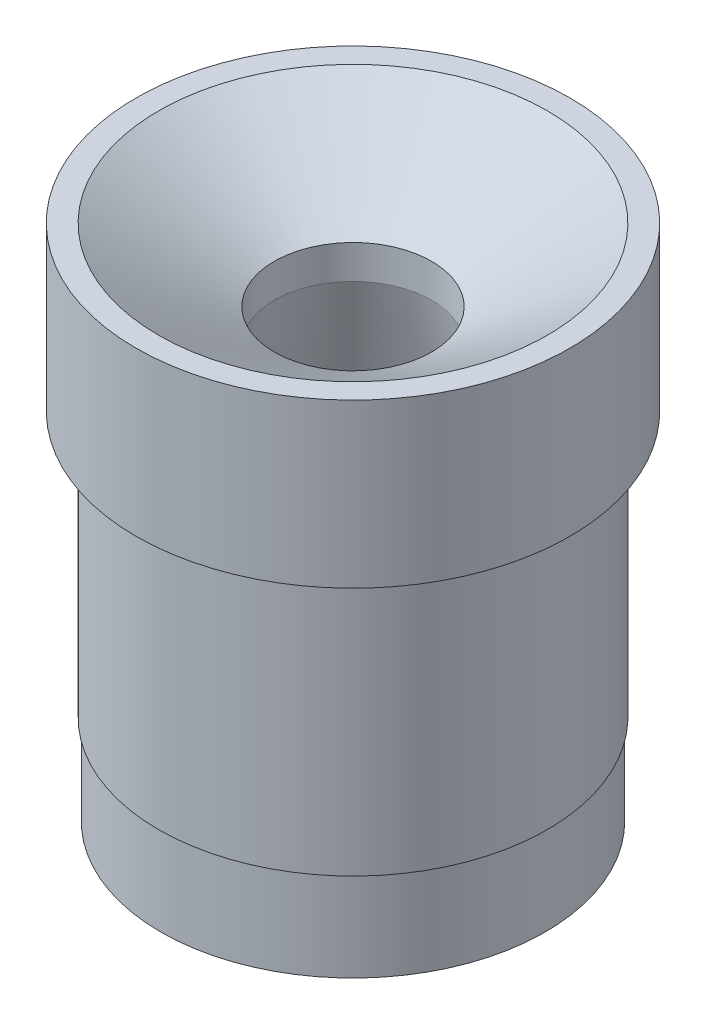
ISO-10303-21;
HEADER;
FILE_DESCRIPTION(('STEP AP214'),'2;1');
FILE_NAME('part.step','',(''),(''),'','','');
FILE_SCHEMA(('AUTOMOTIVE_DESIGN { 1 0 10303 214 1 1 1 1 }'));
ENDSEC;
DATA;
#1=APPLICATION_CONTEXT('core data for automotive mechanical design processes');
#2=APPLICATION_PROTOCOL_DEFINITION('international standard','automotive_design',2000,#1);
#3=PRODUCT_CONTEXT('',#1,'mechanical');
#4=PRODUCT('Part','Part','',(#3));
#5=PRODUCT_RELATED_PRODUCT_CATEGORY('part','',(#4));
#6=PRODUCT_DEFINITION_FORMATION('','',#4);
#7=PRODUCT_DEFINITION_CONTEXT('part definition',#1,'design');
#8=PRODUCT_DEFINITION('design','',#6,#7);
#9=PRODUCT_DEFINITION_SHAPE('','',#8);
#10=(LENGTH_UNIT() NAMED_UNIT(*) SI_UNIT(.MILLI.,.METRE.));
#11=(NAMED_UNIT(*) PLANE_ANGLE_UNIT() SI_UNIT($,.RADIAN.));
#12=(NAMED_UNIT(*) SI_UNIT($,.STERADIAN.) SOLID_ANGLE_UNIT());
#13=UNCERTAINTY_MEASURE_WITH_UNIT(LENGTH_MEASURE(1.E-05),#10,'distance_accuracy_value','');
#14=(GEOMETRIC_REPRESENTATION_CONTEXT(3) GLOBAL_UNCERTAINTY_ASSIGNED_CONTEXT((#13)) GLOBAL_UNIT_ASSIGNED_CONTEXT((#10,
#11,#12)) REPRESENTATION_CONTEXT('',''));
#15=CARTESIAN_POINT('',(0.,0.,0.));
#16=DIRECTION('',(0.,0.,1.));
#17=DIRECTION('',(1.,0.,0.));
#18=AXIS2_PLACEMENT_3D('',#15,#16,#17);
#19=CARTESIAN_POINT('',(0.,0.,-24.511));
#20=DIRECTION('',(0.,1.,0.));
#21=DIRECTION('',(0.,0.,1.));
#22=AXIS2_PLACEMENT_3D('',#19,#20,#21);
#23=PLANE('',#22);
#24=CARTESIAN_POINT('',(0.,0.,0.));
#25=DIRECTION('',(0.,1.,0.));
#26=DIRECTION('',(0.,0.,1.));
#27=AXIS2_PLACEMENT_3D('',#24,#25,#26);
#28=CIRCLE('',#27,24.511);
#29=CARTESIAN_POINT('',(0.,0.,24.511));
#30=VERTEX_POINT('',#29);
#31=EDGE_CURVE('E87',#30,#30,#28,.T.);
#32=ORIENTED_EDGE('',*,*,#31,.F.);
#33=EDGE_LOOP('',(#32));
#34=FACE_BOUND('',#33,.T.);
#35=CARTESIAN_POINT('',(0.,0.,0.));
#36=DIRECTION('',(0.,1.,0.));
#37=DIRECTION('',(0.,0.,1.));
#38=AXIS2_PLACEMENT_3D('',#35,#36,#37);
#39=CIRCLE('',#38,21.971);
#40=CARTESIAN_POINT('',(0.,0.,21.971));
#41=VERTEX_POINT('',#40);
#42=EDGE_CURVE('E10',#41,#41,#39,.T.);
#43=ORIENTED_EDGE('',*,*,#42,.T.);
#44=EDGE_LOOP('',(#43));
#45=FACE_BOUND('',#44,.T.);
#46=ADVANCED_FACE('F43',(#34,#45),#23,.F.);
#47=CARTESIAN_POINT('',(0.,21.55825,0.));
#48=DIRECTION('',(0.,1.,0.));
#49=DIRECTION('',(0.,0.,1.));
#50=AXIS2_PLACEMENT_3D('',#47,#48,#49);
#51=CYLINDRICAL_SURFACE('',#50,21.971);
#52=ORIENTED_EDGE('',*,*,#42,.F.);
#53=EDGE_LOOP('',(#52));
#54=FACE_BOUND('',#53,.T.);
#55=CARTESIAN_POINT('',(0.,-29.972,0.));
#56=DIRECTION('',(0.,1.,0.));
#57=DIRECTION('',(0.,0.,1.));
#58=AXIS2_PLACEMENT_3D('',#55,#56,#57);
#59=CIRCLE('',#58,21.971);
#60=CARTESIAN_POINT('',(0.,-29.972,21.971));
#61=VERTEX_POINT('',#60);
#62=EDGE_CURVE('E50',#61,#61,#59,.T.);
#63=ORIENTED_EDGE('',*,*,#62,.T.);
#64=EDGE_LOOP('',(#63));
#65=FACE_BOUND('',#64,.T.);
#66=ADVANCED_FACE('F94',(#54,#65),#51,.T.);
#67=CARTESIAN_POINT('',(0.,-29.972,-21.717));
#68=DIRECTION('',(0.,1.,0.));
#69=DIRECTION('',(0.,0.,1.));
#70=AXIS2_PLACEMENT_3D('',#67,#68,#69);
#71=PLANE('',#70);
#72=ORIENTED_EDGE('',*,*,#62,.F.);
#73=EDGE_LOOP('',(#72));
#74=FACE_BOUND('',#73,.T.);
#75=CARTESIAN_POINT('',(0.,-29.972,0.));
#76=DIRECTION('',(0.,1.,0.));
#77=DIRECTION('',(0.,0.,1.));
#78=AXIS2_PLACEMENT_3D('',#75,#76,#77);
#79=CIRCLE('',#78,21.717);
#80=CARTESIAN_POINT('',(0.,-29.972,21.717));
#81=VERTEX_POINT('',#80);
#82=EDGE_CURVE('E57',#81,#81,#79,.T.);
#83=ORIENTED_EDGE('',*,*,#82,.T.);
#84=EDGE_LOOP('',(#83));
#85=FACE_BOUND('',#84,.T.);
#86=ADVANCED_FACE('F99',(#74,#85),#71,.F.);
#87=CARTESIAN_POINT('',(0.,21.55825,0.));
#88=DIRECTION('',(0.,1.,0.));
#89=DIRECTION('',(0.,0.,1.));
#90=AXIS2_PLACEMENT_3D('',#87,#88,#89);
#91=CYLINDRICAL_SURFACE('',#90,21.717);
#92=ORIENTED_EDGE('',*,*,#82,.F.);
#93=EDGE_LOOP('',(#92));
#94=FACE_BOUND('',#93,.T.);
#95=CARTESIAN_POINT('',(0.,-40.132,0.));
#96=DIRECTION('',(0.,1.,0.));
#97=DIRECTION('',(0.,0.,1.));
#98=AXIS2_PLACEMENT_3D('',#95,#96,#97);
#99=CIRCLE('',#98,21.717);
#100=CARTESIAN_POINT('',(0.,-40.132,21.717));
#101=VERTEX_POINT('',#100);
#102=EDGE_CURVE('E63',#101,#101,#99,.T.);
#103=ORIENTED_EDGE('',*,*,#102,.T.);
#104=EDGE_LOOP('',(#103));
#105=FACE_BOUND('',#104,.T.);
#106=ADVANCED_FACE('F104',(#94,#105),#91,.T.);
#107=CARTESIAN_POINT('',(0.,-40.132,-21.717));
#108=DIRECTION('',(0.,1.,0.));
#109=DIRECTION('',(0.,0.,1.));
#110=AXIS2_PLACEMENT_3D('',#107,#108,#109);
#111=PLANE('',#110);
#112=ORIENTED_EDGE('',*,*,#102,.F.);
#113=EDGE_LOOP('',(#112));
#114=FACE_BOUND('',#113,.T.);
#115=CARTESIAN_POINT('',(0.,-40.132,0.));
#116=DIRECTION('',(0.,1.,0.));
#117=DIRECTION('',(0.,0.,1.));
#118=AXIS2_PLACEMENT_3D('',#115,#116,#117);
#119=CIRCLE('',#118,20.066);
#120=CARTESIAN_POINT('',(0.,-40.132,20.066));
#121=VERTEX_POINT('',#120);
#122=EDGE_CURVE('E69',#121,#121,#119,.T.);
#123=ORIENTED_EDGE('',*,*,#122,.T.);
#124=EDGE_LOOP('',(#123));
#125=FACE_BOUND('',#124,.T.);
#126=ADVANCED_FACE('F110',(#114,#125),#111,.F.);
#127=CARTESIAN_POINT('',(0.,6.4193902305304,0.));
#128=DIRECTION('',(0.,-1.,0.));
#129=DIRECTION('',(0.,0.,-1.));
#130=AXIS2_PLACEMENT_3D('',#127,#128,#129);
#131=CONICAL_SURFACE('',#130,8.89,0.235619449019235);
#132=ORIENTED_EDGE('',*,*,#122,.F.);
#133=EDGE_LOOP('',(#132));
#134=FACE_BOUND('',#133,.T.);
#135=CARTESIAN_POINT('',(0.,6.4193902305304,0.));
#136=DIRECTION('',(0.,1.,0.));
#137=DIRECTION('',(0.,0.,1.));
#138=AXIS2_PLACEMENT_3D('',#135,#136,#137);
#139=CIRCLE('',#138,8.89);
#140=CARTESIAN_POINT('',(0.,6.4193902305304,8.89));
#141=VERTEX_POINT('',#140);
#142=EDGE_CURVE('E73',#141,#141,#139,.T.);
#143=ORIENTED_EDGE('',*,*,#142,.T.);
#144=EDGE_LOOP('',(#143));
#145=FACE_BOUND('',#144,.T.);
#146=ADVANCED_FACE('F114',(#134,#145),#131,.F.);
#147=CARTESIAN_POINT('',(0.,21.55825,0.));
#148=DIRECTION('',(0.,1.,0.));
#149=DIRECTION('',(0.,0.,1.));
#150=AXIS2_PLACEMENT_3D('',#147,#148,#149);
#151=CYLINDRICAL_SURFACE('',#150,8.89);
#152=ORIENTED_EDGE('',*,*,#142,.F.);
#153=EDGE_LOOP('',(#152));
#154=FACE_BOUND('',#153,.T.);
#155=CARTESIAN_POINT('',(0.,10.2293902305304,0.));
#156=DIRECTION('',(0.,1.,0.));
#157=DIRECTION('',(0.,0.,1.));
#158=AXIS2_PLACEMENT_3D('',#155,#156,#157);
#159=CIRCLE('',#158,8.89);
#160=CARTESIAN_POINT('',(0.,10.2293902305304,8.89));
#161=VERTEX_POINT('',#160);
#162=EDGE_CURVE('E76',#161,#161,#159,.T.);
#163=ORIENTED_EDGE('',*,*,#162,.T.);
#164=EDGE_LOOP('',(#163));
#165=FACE_BOUND('',#164,.T.);
#166=ADVANCED_FACE('F117',(#154,#165),#151,.F.);
#167=CARTESIAN_POINT('',(0.,18.415,0.));
#168=DIRECTION('',(0.,1.,0.));
#169=DIRECTION('',(0.,0.,1.));
#170=AXIS2_PLACEMENT_3D('',#167,#168,#169);
#171=CONICAL_SURFACE('',#170,21.971,1.01164830753766);
#172=ORIENTED_EDGE('',*,*,#162,.F.);
#173=EDGE_LOOP('',(#172));
#174=FACE_BOUND('',#173,.T.);
#175=CARTESIAN_POINT('',(0.,18.415,0.));
#176=DIRECTION('',(0.,1.,0.));
#177=DIRECTION('',(0.,0.,1.));
#178=AXIS2_PLACEMENT_3D('',#175,#176,#177);
#179=CIRCLE('',#178,21.971);
#180=CARTESIAN_POINT('',(0.,18.415,21.971));
#181=VERTEX_POINT('',#180);
#182=EDGE_CURVE('E80',#181,#181,#179,.T.);
#183=ORIENTED_EDGE('',*,*,#182,.T.);
#184=EDGE_LOOP('',(#183));
#185=FACE_BOUND('',#184,.T.);
#186=ADVANCED_FACE('F121',(#174,#185),#171,.F.);
#187=CARTESIAN_POINT('',(0.,18.415,-21.971));
#188=DIRECTION('',(0.,-1.,0.));
#189=DIRECTION('',(0.,0.,-1.));
#190=AXIS2_PLACEMENT_3D('',#187,#188,#189);
#191=PLANE('',#190);
#192=ORIENTED_EDGE('',*,*,#182,.F.);
#193=EDGE_LOOP('',(#192));
#194=FACE_BOUND('',#193,.T.);
#195=CARTESIAN_POINT('',(0.,18.415,0.));
#196=DIRECTION('',(0.,1.,0.));
#197=DIRECTION('',(0.,0.,1.));
#198=AXIS2_PLACEMENT_3D('',#195,#196,#197);
#199=CIRCLE('',#198,24.511);
#200=CARTESIAN_POINT('',(0.,18.415,24.511));
#201=VERTEX_POINT('',#200);
#202=EDGE_CURVE('E84',#201,#201,#199,.T.);
#203=ORIENTED_EDGE('',*,*,#202,.T.);
#204=EDGE_LOOP('',(#203));
#205=FACE_BOUND('',#204,.T.);
#206=ADVANCED_FACE('F124',(#194,#205),#191,.F.);
#207=CARTESIAN_POINT('',(0.,21.55825,0.));
#208=DIRECTION('',(0.,1.,0.));
#209=DIRECTION('',(0.,0.,1.));
#210=AXIS2_PLACEMENT_3D('',#207,#208,#209);
#211=CYLINDRICAL_SURFACE('',#210,24.511);
#212=ORIENTED_EDGE('',*,*,#202,.F.);
#213=EDGE_LOOP('',(#212));
#214=FACE_BOUND('',#213,.T.);
#215=ORIENTED_EDGE('',*,*,#31,.T.);
#216=EDGE_LOOP('',(#215));
#217=FACE_BOUND('',#216,.T.);
#218=ADVANCED_FACE('F91',(#214,#217),#211,.T.);
#219=CLOSED_SHELL('',(#46,#66,#86,#106,#126,#146,#166,#186,#206,#218));
#220=MANIFOLD_SOLID_BREP('B2',#219);
#221=ADVANCED_BREP_SHAPE_REPRESENTATION('',(#18,#220),#14);
#222=SHAPE_DEFINITION_REPRESENTATION(#9,#221);
ENDSEC;
END-ISO-10303-21;
